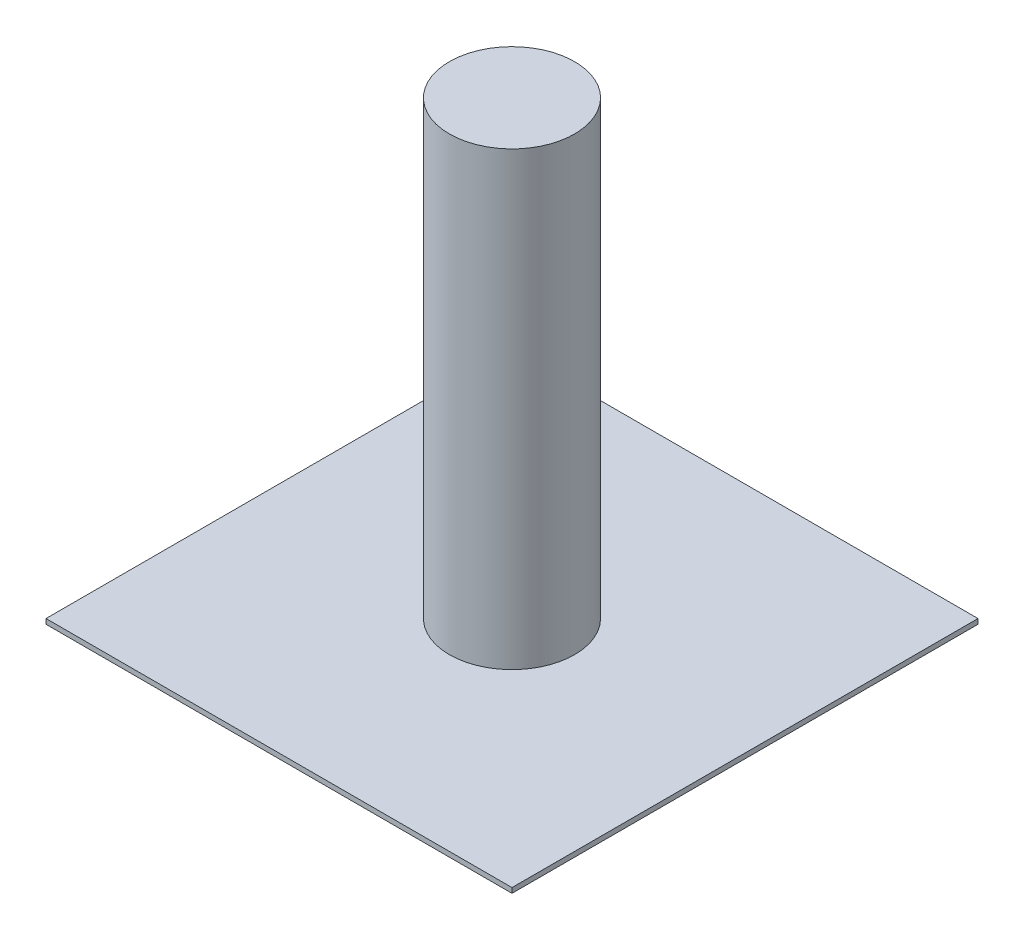
ISO-10303-21;
HEADER;
FILE_DESCRIPTION(('STEP AP214'),'2;1');
FILE_NAME('part.step','',(''),(''),'','','');
FILE_SCHEMA(('AUTOMOTIVE_DESIGN { 1 0 10303 214 1 1 1 1 }'));
ENDSEC;
DATA;
#1=APPLICATION_CONTEXT('core data for automotive mechanical design processes');
#2=APPLICATION_PROTOCOL_DEFINITION('international standard','automotive_design',2000,#1);
#3=PRODUCT_CONTEXT('',#1,'mechanical');
#4=PRODUCT('Part','Part','',(#3));
#5=PRODUCT_RELATED_PRODUCT_CATEGORY('part','',(#4));
#6=PRODUCT_DEFINITION_FORMATION('','',#4);
#7=PRODUCT_DEFINITION_CONTEXT('part definition',#1,'design');
#8=PRODUCT_DEFINITION('design','',#6,#7);
#9=PRODUCT_DEFINITION_SHAPE('','',#8);
#10=(LENGTH_UNIT() NAMED_UNIT(*) SI_UNIT(.MILLI.,.METRE.));
#11=(NAMED_UNIT(*) PLANE_ANGLE_UNIT() SI_UNIT($,.RADIAN.));
#12=(NAMED_UNIT(*) SI_UNIT($,.STERADIAN.) SOLID_ANGLE_UNIT());
#13=UNCERTAINTY_MEASURE_WITH_UNIT(LENGTH_MEASURE(1.E-05),#10,'distance_accuracy_value','');
#14=(GEOMETRIC_REPRESENTATION_CONTEXT(3) GLOBAL_UNCERTAINTY_ASSIGNED_CONTEXT((#13)) GLOBAL_UNIT_ASSIGNED_CONTEXT((#10,
#11,#12)) REPRESENTATION_CONTEXT('',''));
#15=CARTESIAN_POINT('',(0.,0.,0.));
#16=DIRECTION('',(0.,0.,1.));
#17=DIRECTION('',(1.,0.,0.));
#18=AXIS2_PLACEMENT_3D('',#15,#16,#17);
#19=CARTESIAN_POINT('',(93.,2.,-93.));
#20=DIRECTION('',(-1.,0.,0.));
#21=DIRECTION('',(0.,0.,1.));
#22=AXIS2_PLACEMENT_3D('',#19,#20,#21);
#23=PLANE('',#22);
#24=DIRECTION('',(0.,0.,-1.));
#25=VECTOR('',#24,1.);
#26=CARTESIAN_POINT('',(93.,0.,-93.));
#27=LINE('',#26,#25);
#28=CARTESIAN_POINT('',(93.,0.,93.));
#29=VERTEX_POINT('',#28);
#30=CARTESIAN_POINT('',(93.,0.,-93.));
#31=VERTEX_POINT('',#30);
#32=EDGE_CURVE('E110',#29,#31,#27,.T.);
#33=ORIENTED_EDGE('',*,*,#32,.T.);
#34=DIRECTION('',(0.,-1.,0.));
#35=VECTOR('',#34,1.);
#36=CARTESIAN_POINT('',(93.,2.,-93.));
#37=LINE('',#36,#35);
#38=CARTESIAN_POINT('',(93.,2.,-93.));
#39=VERTEX_POINT('',#38);
#40=EDGE_CURVE('E42',#39,#31,#37,.T.);
#41=ORIENTED_EDGE('',*,*,#40,.F.);
#42=DIRECTION('',(0.,0.,-1.));
#43=VECTOR('',#42,1.);
#44=CARTESIAN_POINT('',(93.,2.,-93.));
#45=LINE('',#44,#43);
#46=CARTESIAN_POINT('',(93.,2.,93.));
#47=VERTEX_POINT('',#46);
#48=EDGE_CURVE('E93',#47,#39,#45,.T.);
#49=ORIENTED_EDGE('',*,*,#48,.F.);
#50=DIRECTION('',(0.,-1.,0.));
#51=VECTOR('',#50,1.);
#52=CARTESIAN_POINT('',(93.,2.,93.));
#53=LINE('',#52,#51);
#54=EDGE_CURVE('E106',#47,#29,#53,.T.);
#55=ORIENTED_EDGE('',*,*,#54,.T.);
#56=EDGE_LOOP('',(#33,#41,#49,#55));
#57=FACE_BOUND('',#56,.T.);
#58=ADVANCED_FACE('F39',(#57),#23,.F.);
#59=CARTESIAN_POINT('',(-93.,2.,-93.));
#60=DIRECTION('',(0.,0.,1.));
#61=DIRECTION('',(1.,0.,0.));
#62=AXIS2_PLACEMENT_3D('',#59,#60,#61);
#63=PLANE('',#62);
#64=DIRECTION('',(-1.,0.,0.));
#65=VECTOR('',#64,1.);
#66=CARTESIAN_POINT('',(-93.,0.,-93.));
#67=LINE('',#66,#65);
#68=CARTESIAN_POINT('',(-93.,0.,-93.));
#69=VERTEX_POINT('',#68);
#70=EDGE_CURVE('E99',#31,#69,#67,.T.);
#71=ORIENTED_EDGE('',*,*,#70,.T.);
#72=DIRECTION('',(0.,-1.,0.));
#73=VECTOR('',#72,1.);
#74=CARTESIAN_POINT('',(-93.,2.,-93.));
#75=LINE('',#74,#73);
#76=CARTESIAN_POINT('',(-93.,2.,-93.));
#77=VERTEX_POINT('',#76);
#78=EDGE_CURVE('E97',#77,#69,#75,.T.);
#79=ORIENTED_EDGE('',*,*,#78,.F.);
#80=DIRECTION('',(-1.,0.,0.));
#81=VECTOR('',#80,1.);
#82=CARTESIAN_POINT('',(-93.,2.,-93.));
#83=LINE('',#82,#81);
#84=EDGE_CURVE('E88',#39,#77,#83,.T.);
#85=ORIENTED_EDGE('',*,*,#84,.F.);
#86=ORIENTED_EDGE('',*,*,#40,.T.);
#87=EDGE_LOOP('',(#71,#79,#85,#86));
#88=FACE_BOUND('',#87,.T.);
#89=ADVANCED_FACE('F98',(#88),#63,.F.);
#90=CARTESIAN_POINT('',(-93.,2.,-93.));
#91=DIRECTION('',(1.,0.,0.));
#92=DIRECTION('',(0.,0.,-1.));
#93=AXIS2_PLACEMENT_3D('',#90,#91,#92);
#94=PLANE('',#93);
#95=DIRECTION('',(0.,0.,1.));
#96=VECTOR('',#95,1.);
#97=CARTESIAN_POINT('',(-93.,0.,-93.));
#98=LINE('',#97,#96);
#99=CARTESIAN_POINT('',(-93.,0.,93.));
#100=VERTEX_POINT('',#99);
#101=EDGE_CURVE('E74',#69,#100,#98,.T.);
#102=ORIENTED_EDGE('',*,*,#101,.T.);
#103=DIRECTION('',(0.,-1.,0.));
#104=VECTOR('',#103,1.);
#105=CARTESIAN_POINT('',(-93.,2.,93.));
#106=LINE('',#105,#104);
#107=CARTESIAN_POINT('',(-93.,2.,93.));
#108=VERTEX_POINT('',#107);
#109=EDGE_CURVE('E101',#108,#100,#106,.T.);
#110=ORIENTED_EDGE('',*,*,#109,.F.);
#111=DIRECTION('',(0.,0.,1.));
#112=VECTOR('',#111,1.);
#113=CARTESIAN_POINT('',(-93.,2.,-93.));
#114=LINE('',#113,#112);
#115=EDGE_CURVE('E91',#77,#108,#114,.T.);
#116=ORIENTED_EDGE('',*,*,#115,.F.);
#117=ORIENTED_EDGE('',*,*,#78,.T.);
#118=EDGE_LOOP('',(#102,#110,#116,#117));
#119=FACE_BOUND('',#118,.T.);
#120=ADVANCED_FACE('F102',(#119),#94,.F.);
#121=CARTESIAN_POINT('',(-93.,2.,93.));
#122=DIRECTION('',(0.,0.,-1.));
#123=DIRECTION('',(-1.,0.,0.));
#124=AXIS2_PLACEMENT_3D('',#121,#122,#123);
#125=PLANE('',#124);
#126=DIRECTION('',(1.,0.,0.));
#127=VECTOR('',#126,1.);
#128=CARTESIAN_POINT('',(-93.,0.,93.));
#129=LINE('',#128,#127);
#130=EDGE_CURVE('E80',#100,#29,#129,.T.);
#131=ORIENTED_EDGE('',*,*,#130,.T.);
#132=ORIENTED_EDGE('',*,*,#54,.F.);
#133=DIRECTION('',(1.,0.,0.));
#134=VECTOR('',#133,1.);
#135=CARTESIAN_POINT('',(-93.,2.,93.));
#136=LINE('',#135,#134);
#137=EDGE_CURVE('E57',#108,#47,#136,.T.);
#138=ORIENTED_EDGE('',*,*,#137,.F.);
#139=ORIENTED_EDGE('',*,*,#109,.T.);
#140=EDGE_LOOP('',(#131,#132,#138,#139));
#141=FACE_BOUND('',#140,.T.);
#142=ADVANCED_FACE('F124',(#141),#125,.F.);
#143=CARTESIAN_POINT('',(0.,2.,0.));
#144=DIRECTION('',(0.,1.,0.));
#145=DIRECTION('',(0.,0.,1.));
#146=AXIS2_PLACEMENT_3D('',#143,#144,#145);
#147=PLANE('',#146);
#148=CARTESIAN_POINT('',(0.,2.,0.));
#149=DIRECTION('',(0.,1.,0.));
#150=DIRECTION('',(0.,0.,1.));
#151=AXIS2_PLACEMENT_3D('',#148,#149,#150);
#152=CIRCLE('',#151,25.);
#153=CARTESIAN_POINT('',(0.,2.,25.));
#154=VERTEX_POINT('',#153);
#155=EDGE_CURVE('E11',#154,#154,#152,.T.);
#156=ORIENTED_EDGE('',*,*,#155,.F.);
#157=EDGE_LOOP('',(#156));
#158=FACE_BOUND('',#157,.T.);
#159=ORIENTED_EDGE('',*,*,#48,.T.);
#160=ORIENTED_EDGE('',*,*,#84,.T.);
#161=ORIENTED_EDGE('',*,*,#115,.T.);
#162=ORIENTED_EDGE('',*,*,#137,.T.);
#163=EDGE_LOOP('',(#159,#160,#161,#162));
#164=FACE_BOUND('',#163,.T.);
#165=ADVANCED_FACE('F89',(#158,#164),#147,.T.);
#166=CARTESIAN_POINT('',(0.,0.,0.));
#167=DIRECTION('',(0.,1.,0.));
#168=DIRECTION('',(0.,0.,1.));
#169=AXIS2_PLACEMENT_3D('',#166,#167,#168);
#170=PLANE('',#169);
#171=ORIENTED_EDGE('',*,*,#32,.F.);
#172=ORIENTED_EDGE('',*,*,#130,.F.);
#173=ORIENTED_EDGE('',*,*,#101,.F.);
#174=ORIENTED_EDGE('',*,*,#70,.F.);
#175=EDGE_LOOP('',(#171,#172,#173,#174));
#176=FACE_BOUND('',#175,.T.);
#177=ADVANCED_FACE('F127',(#176),#170,.F.);
#178=CARTESIAN_POINT('',(0.,182.,0.));
#179=DIRECTION('',(0.,-1.,0.));
#180=DIRECTION('',(0.,0.,-1.));
#181=AXIS2_PLACEMENT_3D('',#178,#179,#180);
#182=CYLINDRICAL_SURFACE('',#181,25.);
#183=CARTESIAN_POINT('',(0.,182.,0.));
#184=DIRECTION('',(0.,1.,0.));
#185=DIRECTION('',(0.,0.,1.));
#186=AXIS2_PLACEMENT_3D('',#183,#184,#185);
#187=CIRCLE('',#186,25.);
#188=CARTESIAN_POINT('',(0.,182.,25.));
#189=VERTEX_POINT('',#188);
#190=EDGE_CURVE('E114',#189,#189,#187,.T.);
#191=ORIENTED_EDGE('',*,*,#190,.F.);
#192=EDGE_LOOP('',(#191));
#193=FACE_BOUND('',#192,.T.);
#194=ORIENTED_EDGE('',*,*,#155,.T.);
#195=EDGE_LOOP('',(#194));
#196=FACE_BOUND('',#195,.T.);
#197=ADVANCED_FACE('F137',(#193,#196),#182,.T.);
#198=CARTESIAN_POINT('',(0.,182.,0.));
#199=DIRECTION('',(0.,1.,0.));
#200=DIRECTION('',(0.,0.,1.));
#201=AXIS2_PLACEMENT_3D('',#198,#199,#200);
#202=PLANE('',#201);
#203=ORIENTED_EDGE('',*,*,#190,.T.);
#204=EDGE_LOOP('',(#203));
#205=FACE_BOUND('',#204,.T.);
#206=ADVANCED_FACE('F135',(#205),#202,.T.);
#207=CLOSED_SHELL('',(#58,#89,#120,#142,#165,#177,#197,#206));
#208=MANIFOLD_SOLID_BREP('B2',#207);
#209=ADVANCED_BREP_SHAPE_REPRESENTATION('',(#18,#208),#14);
#210=SHAPE_DEFINITION_REPRESENTATION(#9,#209);
ENDSEC;
END-ISO-10303-21;
